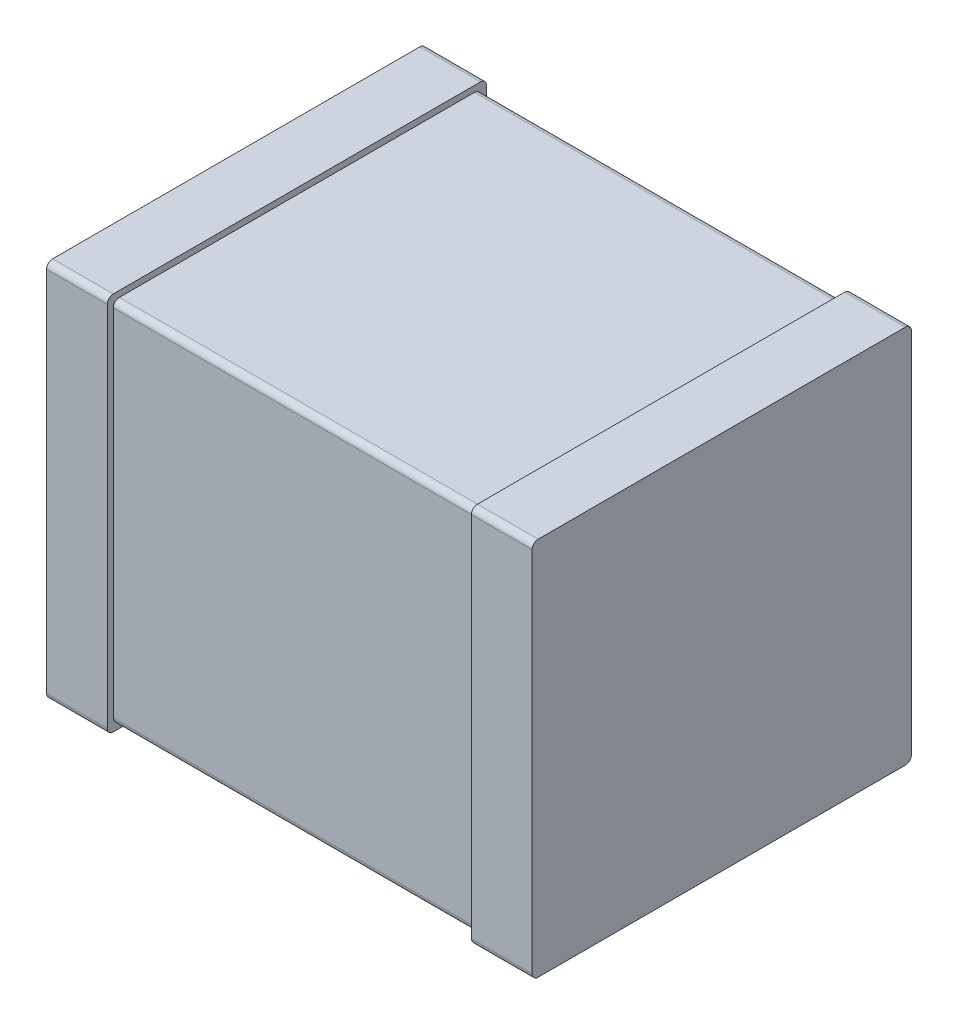
ISO-10303-21;
HEADER;
FILE_DESCRIPTION(('STEP AP214'),'2;1');
FILE_NAME('part.step','',(''),(''),'','','');
FILE_SCHEMA(('AUTOMOTIVE_DESIGN { 1 0 10303 214 1 1 1 1 }'));
ENDSEC;
DATA;
#1=APPLICATION_CONTEXT('core data for automotive mechanical design processes');
#2=APPLICATION_PROTOCOL_DEFINITION('international standard','automotive_design',2000,#1);
#3=PRODUCT_CONTEXT('',#1,'mechanical');
#4=PRODUCT('Part','Part','',(#3));
#5=PRODUCT_RELATED_PRODUCT_CATEGORY('part','',(#4));
#6=PRODUCT_DEFINITION_FORMATION('','',#4);
#7=PRODUCT_DEFINITION_CONTEXT('part definition',#1,'design');
#8=PRODUCT_DEFINITION('design','',#6,#7);
#9=PRODUCT_DEFINITION_SHAPE('','',#8);
#10=(LENGTH_UNIT() NAMED_UNIT(*) SI_UNIT(.MILLI.,.METRE.));
#11=(NAMED_UNIT(*) PLANE_ANGLE_UNIT() SI_UNIT($,.RADIAN.));
#12=(NAMED_UNIT(*) SI_UNIT($,.STERADIAN.) SOLID_ANGLE_UNIT());
#13=UNCERTAINTY_MEASURE_WITH_UNIT(LENGTH_MEASURE(1.E-05),#10,'distance_accuracy_value','');
#14=(GEOMETRIC_REPRESENTATION_CONTEXT(3) GLOBAL_UNCERTAINTY_ASSIGNED_CONTEXT((#13)) GLOBAL_UNIT_ASSIGNED_CONTEXT((#10,
#11,#12)) REPRESENTATION_CONTEXT('',''));
#15=CARTESIAN_POINT('',(0.,0.,0.));
#16=DIRECTION('',(0.,0.,1.));
#17=DIRECTION('',(1.,0.,0.));
#18=AXIS2_PLACEMENT_3D('',#15,#16,#17);
#19=CARTESIAN_POINT('',(1.6,-1.25,0.));
#20=DIRECTION('',(1.,0.,0.));
#21=DIRECTION('',(0.,1.,0.));
#22=AXIS2_PLACEMENT_3D('',#19,#20,#21);
#23=PLANE('',#22);
#24=DIRECTION('',(0.,0.,1.));
#25=VECTOR('',#24,1.);
#26=CARTESIAN_POINT('',(1.6,-1.25,0.));
#27=LINE('',#26,#25);
#28=CARTESIAN_POINT('',(1.6,-1.25,0.04));
#29=VERTEX_POINT('',#28);
#30=CARTESIAN_POINT('',(1.6,-1.25,2.46));
#31=VERTEX_POINT('',#30);
#32=EDGE_CURVE('E309',#29,#31,#27,.T.);
#33=ORIENTED_EDGE('',*,*,#32,.F.);
#34=CARTESIAN_POINT('',(1.6,-1.21,0.04));
#35=DIRECTION('',(1.,0.,0.));
#36=DIRECTION('',(0.,0.,1.));
#37=AXIS2_PLACEMENT_3D('',#34,#35,#36);
#38=CIRCLE('',#37,0.04);
#39=CARTESIAN_POINT('',(1.6,-1.21,0.));
#40=VERTEX_POINT('',#39);
#41=EDGE_CURVE('E316',#29,#40,#38,.T.);
#42=ORIENTED_EDGE('',*,*,#41,.T.);
#43=DIRECTION('',(0.,1.,0.));
#44=VECTOR('',#43,1.);
#45=CARTESIAN_POINT('',(1.6,-1.25,0.));
#46=LINE('',#45,#44);
#47=CARTESIAN_POINT('',(1.6,1.21,0.));
#48=VERTEX_POINT('',#47);
#49=EDGE_CURVE('E252',#40,#48,#46,.T.);
#50=ORIENTED_EDGE('',*,*,#49,.T.);
#51=CARTESIAN_POINT('',(1.6,1.21,0.04));
#52=DIRECTION('',(-1.,0.,0.));
#53=DIRECTION('',(0.,0.,1.));
#54=AXIS2_PLACEMENT_3D('',#51,#52,#53);
#55=CIRCLE('',#54,0.04);
#56=CARTESIAN_POINT('',(1.6,1.25,0.04));
#57=VERTEX_POINT('',#56);
#58=EDGE_CURVE('E223',#57,#48,#55,.T.);
#59=ORIENTED_EDGE('',*,*,#58,.F.);
#60=DIRECTION('',(0.,0.,1.));
#61=VECTOR('',#60,1.);
#62=CARTESIAN_POINT('',(1.6,1.25,0.));
#63=LINE('',#62,#61);
#64=CARTESIAN_POINT('',(1.6,1.25,2.46));
#65=VERTEX_POINT('',#64);
#66=EDGE_CURVE('E11',#57,#65,#63,.T.);
#67=ORIENTED_EDGE('',*,*,#66,.T.);
#68=CARTESIAN_POINT('',(1.6,1.21,2.46));
#69=DIRECTION('',(1.,0.,0.));
#70=DIRECTION('',(0.,0.,1.));
#71=AXIS2_PLACEMENT_3D('',#68,#69,#70);
#72=CIRCLE('',#71,0.04);
#73=CARTESIAN_POINT('',(1.6,1.21,2.5));
#74=VERTEX_POINT('',#73);
#75=EDGE_CURVE('E228',#65,#74,#72,.T.);
#76=ORIENTED_EDGE('',*,*,#75,.T.);
#77=DIRECTION('',(0.,1.,0.));
#78=VECTOR('',#77,1.);
#79=CARTESIAN_POINT('',(1.6,-1.25,2.5));
#80=LINE('',#79,#78);
#81=CARTESIAN_POINT('',(1.6,-1.21,2.5));
#82=VERTEX_POINT('',#81);
#83=EDGE_CURVE('E232',#82,#74,#80,.T.);
#84=ORIENTED_EDGE('',*,*,#83,.F.);
#85=CARTESIAN_POINT('',(1.6,-1.21,2.46));
#86=DIRECTION('',(-1.,0.,0.));
#87=DIRECTION('',(0.,0.,1.));
#88=AXIS2_PLACEMENT_3D('',#85,#86,#87);
#89=CIRCLE('',#88,0.04);
#90=EDGE_CURVE('E262',#31,#82,#89,.T.);
#91=ORIENTED_EDGE('',*,*,#90,.F.);
#92=EDGE_LOOP('',(#33,#42,#50,#59,#67,#76,#84,#91));
#93=FACE_BOUND('',#92,.T.);
#94=ADVANCED_FACE('F17',(#93),#23,.T.);
#95=CARTESIAN_POINT('',(1.2,1.25,0.));
#96=DIRECTION('',(0.,1.,0.));
#97=DIRECTION('',(1.,0.,0.));
#98=AXIS2_PLACEMENT_3D('',#95,#96,#97);
#99=PLANE('',#98);
#100=ORIENTED_EDGE('',*,*,#66,.F.);
#101=DIRECTION('',(1.,0.,0.));
#102=VECTOR('',#101,1.);
#103=CARTESIAN_POINT('',(1.2,1.25,0.04));
#104=LINE('',#103,#102);
#105=CARTESIAN_POINT('',(1.2,1.25,0.04));
#106=VERTEX_POINT('',#105);
#107=EDGE_CURVE('E246',#106,#57,#104,.T.);
#108=ORIENTED_EDGE('',*,*,#107,.F.);
#109=DIRECTION('',(0.,0.,1.));
#110=VECTOR('',#109,1.);
#111=CARTESIAN_POINT('',(1.2,1.25,0.));
#112=LINE('',#111,#110);
#113=CARTESIAN_POINT('',(1.2,1.25,2.46));
#114=VERTEX_POINT('',#113);
#115=EDGE_CURVE('E272',#106,#114,#112,.T.);
#116=ORIENTED_EDGE('',*,*,#115,.T.);
#117=DIRECTION('',(1.,0.,0.));
#118=VECTOR('',#117,1.);
#119=CARTESIAN_POINT('',(1.2,1.25,2.46));
#120=LINE('',#119,#118);
#121=EDGE_CURVE('E26',#114,#65,#120,.T.);
#122=ORIENTED_EDGE('',*,*,#121,.T.);
#123=EDGE_LOOP('',(#100,#108,#116,#122));
#124=FACE_BOUND('',#123,.T.);
#125=ADVANCED_FACE('F270',(#124),#99,.T.);
#126=CARTESIAN_POINT('',(1.2,1.21,2.46));
#127=DIRECTION('',(1.,0.,0.));
#128=DIRECTION('',(0.,1.,0.));
#129=AXIS2_PLACEMENT_3D('',#126,#127,#128);
#130=CYLINDRICAL_SURFACE('',#129,0.04);
#131=CARTESIAN_POINT('',(1.2,1.21,2.46));
#132=DIRECTION('',(1.,0.,0.));
#133=DIRECTION('',(0.,0.,1.));
#134=AXIS2_PLACEMENT_3D('',#131,#132,#133);
#135=CIRCLE('',#134,0.04);
#136=CARTESIAN_POINT('',(1.2,1.21,2.5));
#137=VERTEX_POINT('',#136);
#138=EDGE_CURVE('E241',#114,#137,#135,.T.);
#139=ORIENTED_EDGE('',*,*,#138,.T.);
#140=DIRECTION('',(1.,0.,0.));
#141=VECTOR('',#140,1.);
#142=CARTESIAN_POINT('',(1.2,1.21,2.5));
#143=LINE('',#142,#141);
#144=EDGE_CURVE('E238',#137,#74,#143,.T.);
#145=ORIENTED_EDGE('',*,*,#144,.T.);
#146=ORIENTED_EDGE('',*,*,#75,.F.);
#147=ORIENTED_EDGE('',*,*,#121,.F.);
#148=EDGE_LOOP('',(#139,#145,#146,#147));
#149=FACE_BOUND('',#148,.T.);
#150=ADVANCED_FACE('F239',(#149),#130,.T.);
#151=CARTESIAN_POINT('',(1.2,1.21,0.04));
#152=DIRECTION('',(1.,0.,0.));
#153=DIRECTION('',(0.,1.,0.));
#154=AXIS2_PLACEMENT_3D('',#151,#152,#153);
#155=CYLINDRICAL_SURFACE('',#154,0.04);
#156=ORIENTED_EDGE('',*,*,#107,.T.);
#157=ORIENTED_EDGE('',*,*,#58,.T.);
#158=DIRECTION('',(1.,0.,0.));
#159=VECTOR('',#158,1.);
#160=CARTESIAN_POINT('',(1.2,1.21,0.));
#161=LINE('',#160,#159);
#162=CARTESIAN_POINT('',(1.2,1.21,0.));
#163=VERTEX_POINT('',#162);
#164=EDGE_CURVE('E258',#163,#48,#161,.T.);
#165=ORIENTED_EDGE('',*,*,#164,.F.);
#166=CARTESIAN_POINT('',(1.2,1.21,0.04));
#167=DIRECTION('',(-1.,0.,0.));
#168=DIRECTION('',(0.,0.,1.));
#169=AXIS2_PLACEMENT_3D('',#166,#167,#168);
#170=CIRCLE('',#169,0.04);
#171=EDGE_CURVE('E277',#106,#163,#170,.T.);
#172=ORIENTED_EDGE('',*,*,#171,.F.);
#173=EDGE_LOOP('',(#156,#157,#165,#172));
#174=FACE_BOUND('',#173,.T.);
#175=ADVANCED_FACE('F583',(#174),#155,.T.);
#176=CARTESIAN_POINT('',(1.2,-1.25,2.5));
#177=DIRECTION('',(0.,0.,1.));
#178=DIRECTION('',(1.,0.,0.));
#179=AXIS2_PLACEMENT_3D('',#176,#177,#178);
#180=PLANE('',#179);
#181=DIRECTION('',(0.,1.,0.));
#182=VECTOR('',#181,1.);
#183=CARTESIAN_POINT('',(1.2,-1.25,2.5));
#184=LINE('',#183,#182);
#185=CARTESIAN_POINT('',(1.2,-1.21,2.5));
#186=VERTEX_POINT('',#185);
#187=EDGE_CURVE('E281',#186,#137,#184,.T.);
#188=ORIENTED_EDGE('',*,*,#187,.F.);
#189=DIRECTION('',(1.,0.,0.));
#190=VECTOR('',#189,1.);
#191=CARTESIAN_POINT('',(1.2,-1.21,2.5));
#192=LINE('',#191,#190);
#193=EDGE_CURVE('E249',#186,#82,#192,.T.);
#194=ORIENTED_EDGE('',*,*,#193,.T.);
#195=ORIENTED_EDGE('',*,*,#83,.T.);
#196=ORIENTED_EDGE('',*,*,#144,.F.);
#197=EDGE_LOOP('',(#188,#194,#195,#196));
#198=FACE_BOUND('',#197,.T.);
#199=ADVANCED_FACE('F248',(#198),#180,.T.);
#200=CARTESIAN_POINT('',(1.2,-1.25,0.));
#201=DIRECTION('',(0.,0.,1.));
#202=DIRECTION('',(1.,0.,0.));
#203=AXIS2_PLACEMENT_3D('',#200,#201,#202);
#204=PLANE('',#203);
#205=ORIENTED_EDGE('',*,*,#164,.T.);
#206=ORIENTED_EDGE('',*,*,#49,.F.);
#207=DIRECTION('',(1.,0.,0.));
#208=VECTOR('',#207,1.);
#209=CARTESIAN_POINT('',(1.2,-1.21,0.));
#210=LINE('',#209,#208);
#211=CARTESIAN_POINT('',(1.2,-1.21,0.));
#212=VERTEX_POINT('',#211);
#213=EDGE_CURVE('E313',#212,#40,#210,.T.);
#214=ORIENTED_EDGE('',*,*,#213,.F.);
#215=DIRECTION('',(0.,1.,0.));
#216=VECTOR('',#215,1.);
#217=CARTESIAN_POINT('',(1.2,-1.25,0.));
#218=LINE('',#217,#216);
#219=EDGE_CURVE('E292',#212,#163,#218,.T.);
#220=ORIENTED_EDGE('',*,*,#219,.T.);
#221=EDGE_LOOP('',(#205,#206,#214,#220));
#222=FACE_BOUND('',#221,.T.);
#223=ADVANCED_FACE('F590',(#222),#204,.F.);
#224=CARTESIAN_POINT('',(1.2,-1.21,2.46));
#225=DIRECTION('',(1.,0.,0.));
#226=DIRECTION('',(0.,-1.,0.));
#227=AXIS2_PLACEMENT_3D('',#224,#225,#226);
#228=CYLINDRICAL_SURFACE('',#227,0.04);
#229=DIRECTION('',(1.,0.,0.));
#230=VECTOR('',#229,1.);
#231=CARTESIAN_POINT('',(1.2,-1.25,2.46));
#232=LINE('',#231,#230);
#233=CARTESIAN_POINT('',(1.2,-1.25,2.46));
#234=VERTEX_POINT('',#233);
#235=EDGE_CURVE('E304',#234,#31,#232,.T.);
#236=ORIENTED_EDGE('',*,*,#235,.T.);
#237=ORIENTED_EDGE('',*,*,#90,.T.);
#238=ORIENTED_EDGE('',*,*,#193,.F.);
#239=CARTESIAN_POINT('',(1.2,-1.21,2.46));
#240=DIRECTION('',(-1.,0.,0.));
#241=DIRECTION('',(0.,0.,1.));
#242=AXIS2_PLACEMENT_3D('',#239,#240,#241);
#243=CIRCLE('',#242,0.04);
#244=EDGE_CURVE('E287',#234,#186,#243,.T.);
#245=ORIENTED_EDGE('',*,*,#244,.F.);
#246=EDGE_LOOP('',(#236,#237,#238,#245));
#247=FACE_BOUND('',#246,.T.);
#248=ADVANCED_FACE('F593',(#247),#228,.T.);
#249=CARTESIAN_POINT('',(1.2,-1.21,0.04));
#250=DIRECTION('',(1.,0.,0.));
#251=DIRECTION('',(0.,-1.,0.));
#252=AXIS2_PLACEMENT_3D('',#249,#250,#251);
#253=CYLINDRICAL_SURFACE('',#252,0.04);
#254=CARTESIAN_POINT('',(1.2,-1.21,0.04));
#255=DIRECTION('',(1.,0.,0.));
#256=DIRECTION('',(0.,0.,1.));
#257=AXIS2_PLACEMENT_3D('',#254,#255,#256);
#258=CIRCLE('',#257,0.04);
#259=CARTESIAN_POINT('',(1.2,-1.25,0.04));
#260=VERTEX_POINT('',#259);
#261=EDGE_CURVE('E296',#260,#212,#258,.T.);
#262=ORIENTED_EDGE('',*,*,#261,.T.);
#263=ORIENTED_EDGE('',*,*,#213,.T.);
#264=ORIENTED_EDGE('',*,*,#41,.F.);
#265=DIRECTION('',(1.,0.,0.));
#266=VECTOR('',#265,1.);
#267=CARTESIAN_POINT('',(1.2,-1.25,0.04));
#268=LINE('',#267,#266);
#269=EDGE_CURVE('E308',#260,#29,#268,.T.);
#270=ORIENTED_EDGE('',*,*,#269,.F.);
#271=EDGE_LOOP('',(#262,#263,#264,#270));
#272=FACE_BOUND('',#271,.T.);
#273=ADVANCED_FACE('F597',(#272),#253,.T.);
#274=CARTESIAN_POINT('',(1.2,-1.25,0.));
#275=DIRECTION('',(0.,1.,0.));
#276=DIRECTION('',(1.,0.,0.));
#277=AXIS2_PLACEMENT_3D('',#274,#275,#276);
#278=PLANE('',#277);
#279=ORIENTED_EDGE('',*,*,#235,.F.);
#280=DIRECTION('',(0.,0.,1.));
#281=VECTOR('',#280,1.);
#282=CARTESIAN_POINT('',(1.2,-1.25,0.));
#283=LINE('',#282,#281);
#284=EDGE_CURVE('E300',#260,#234,#283,.T.);
#285=ORIENTED_EDGE('',*,*,#284,.F.);
#286=ORIENTED_EDGE('',*,*,#269,.T.);
#287=ORIENTED_EDGE('',*,*,#32,.T.);
#288=EDGE_LOOP('',(#279,#285,#286,#287));
#289=FACE_BOUND('',#288,.T.);
#290=ADVANCED_FACE('F600',(#289),#278,.F.);
#291=CARTESIAN_POINT('',(1.2,-1.25,0.));
#292=DIRECTION('',(1.,0.,0.));
#293=DIRECTION('',(0.,1.,0.));
#294=AXIS2_PLACEMENT_3D('',#291,#292,#293);
#295=PLANE('',#294);
#296=DIRECTION('',(0.,1.,0.));
#297=VECTOR('',#296,1.);
#298=CARTESIAN_POINT('',(1.2,-1.21,0.04));
#299=LINE('',#298,#297);
#300=CARTESIAN_POINT('',(1.2,-1.17,0.04));
#301=VERTEX_POINT('',#300);
#302=CARTESIAN_POINT('',(1.2,1.17,0.04));
#303=VERTEX_POINT('',#302);
#304=EDGE_CURVE('E379',#301,#303,#299,.T.);
#305=ORIENTED_EDGE('',*,*,#304,.T.);
#306=CARTESIAN_POINT('',(1.2,1.17,0.08));
#307=DIRECTION('',(-1.,0.,0.));
#308=DIRECTION('',(0.,0.,1.));
#309=AXIS2_PLACEMENT_3D('',#306,#307,#308);
#310=CIRCLE('',#309,0.04);
#311=CARTESIAN_POINT('',(1.2,1.21,0.08));
#312=VERTEX_POINT('',#311);
#313=EDGE_CURVE('E390',#312,#303,#310,.T.);
#314=ORIENTED_EDGE('',*,*,#313,.F.);
#315=DIRECTION('',(0.,0.,1.));
#316=VECTOR('',#315,1.);
#317=CARTESIAN_POINT('',(1.2,1.21,0.04));
#318=LINE('',#317,#316);
#319=CARTESIAN_POINT('',(1.2,1.21,2.42));
#320=VERTEX_POINT('',#319);
#321=EDGE_CURVE('E392',#312,#320,#318,.T.);
#322=ORIENTED_EDGE('',*,*,#321,.T.);
#323=CARTESIAN_POINT('',(1.2,1.17,2.42));
#324=DIRECTION('',(1.,0.,0.));
#325=DIRECTION('',(0.,0.,1.));
#326=AXIS2_PLACEMENT_3D('',#323,#324,#325);
#327=CIRCLE('',#326,0.04);
#328=CARTESIAN_POINT('',(1.2,1.17,2.46));
#329=VERTEX_POINT('',#328);
#330=EDGE_CURVE('E402',#320,#329,#327,.T.);
#331=ORIENTED_EDGE('',*,*,#330,.T.);
#332=DIRECTION('',(0.,1.,0.));
#333=VECTOR('',#332,1.);
#334=CARTESIAN_POINT('',(1.2,-1.21,2.46));
#335=LINE('',#334,#333);
#336=CARTESIAN_POINT('',(1.2,-1.17,2.46));
#337=VERTEX_POINT('',#336);
#338=EDGE_CURVE('E410',#337,#329,#335,.T.);
#339=ORIENTED_EDGE('',*,*,#338,.F.);
#340=CARTESIAN_POINT('',(1.2,-1.17,2.42));
#341=DIRECTION('',(-1.,0.,0.));
#342=DIRECTION('',(0.,0.,1.));
#343=AXIS2_PLACEMENT_3D('',#340,#341,#342);
#344=CIRCLE('',#343,0.04);
#345=CARTESIAN_POINT('',(1.2,-1.21,2.42));
#346=VERTEX_POINT('',#345);
#347=EDGE_CURVE('E354',#346,#337,#344,.T.);
#348=ORIENTED_EDGE('',*,*,#347,.F.);
#349=DIRECTION('',(0.,0.,1.));
#350=VECTOR('',#349,1.);
#351=CARTESIAN_POINT('',(1.2,-1.21,0.04));
#352=LINE('',#351,#350);
#353=CARTESIAN_POINT('',(1.2,-1.21,0.08));
#354=VERTEX_POINT('',#353);
#355=EDGE_CURVE('E351',#354,#346,#352,.T.);
#356=ORIENTED_EDGE('',*,*,#355,.F.);
#357=CARTESIAN_POINT('',(1.2,-1.17,0.08));
#358=DIRECTION('',(1.,0.,0.));
#359=DIRECTION('',(0.,0.,1.));
#360=AXIS2_PLACEMENT_3D('',#357,#358,#359);
#361=CIRCLE('',#360,0.04);
#362=EDGE_CURVE('E370',#354,#301,#361,.T.);
#363=ORIENTED_EDGE('',*,*,#362,.T.);
#364=EDGE_LOOP('',(#305,#314,#322,#331,#339,#348,#356,#363));
#365=FACE_BOUND('',#364,.T.);
#366=ORIENTED_EDGE('',*,*,#244,.T.);
#367=ORIENTED_EDGE('',*,*,#187,.T.);
#368=ORIENTED_EDGE('',*,*,#138,.F.);
#369=ORIENTED_EDGE('',*,*,#115,.F.);
#370=ORIENTED_EDGE('',*,*,#171,.T.);
#371=ORIENTED_EDGE('',*,*,#219,.F.);
#372=ORIENTED_EDGE('',*,*,#261,.F.);
#373=ORIENTED_EDGE('',*,*,#284,.T.);
#374=EDGE_LOOP('',(#366,#367,#368,#369,#370,#371,#372,#373));
#375=FACE_BOUND('',#374,.T.);
#376=ADVANCED_FACE('F280',(#365,#375),#295,.F.);
#377=CARTESIAN_POINT('',(-1.2,-1.21,0.04));
#378=DIRECTION('',(0.,1.,0.));
#379=DIRECTION('',(1.,0.,0.));
#380=AXIS2_PLACEMENT_3D('',#377,#378,#379);
#381=PLANE('',#380);
#382=DIRECTION('',(1.,0.,0.));
#383=VECTOR('',#382,1.);
#384=CARTESIAN_POINT('',(-1.2,-1.21,2.42));
#385=LINE('',#384,#383);
#386=CARTESIAN_POINT('',(-1.2,-1.21,2.42));
#387=VERTEX_POINT('',#386);
#388=EDGE_CURVE('E290',#387,#346,#385,.T.);
#389=ORIENTED_EDGE('',*,*,#388,.F.);
#390=DIRECTION('',(0.,0.,1.));
#391=VECTOR('',#390,1.);
#392=CARTESIAN_POINT('',(-1.2,-1.21,0.04));
#393=LINE('',#392,#391);
#394=CARTESIAN_POINT('',(-1.2,-1.21,0.08));
#395=VERTEX_POINT('',#394);
#396=EDGE_CURVE('E346',#395,#387,#393,.T.);
#397=ORIENTED_EDGE('',*,*,#396,.F.);
#398=DIRECTION('',(1.,0.,0.));
#399=VECTOR('',#398,1.);
#400=CARTESIAN_POINT('',(-1.2,-1.21,0.08));
#401=LINE('',#400,#399);
#402=EDGE_CURVE('E373',#395,#354,#401,.T.);
#403=ORIENTED_EDGE('',*,*,#402,.T.);
#404=ORIENTED_EDGE('',*,*,#355,.T.);
#405=EDGE_LOOP('',(#389,#397,#403,#404));
#406=FACE_BOUND('',#405,.T.);
#407=ADVANCED_FACE('F607',(#406),#381,.F.);
#408=CARTESIAN_POINT('',(-1.2,-1.17,2.42));
#409=DIRECTION('',(1.,0.,0.));
#410=DIRECTION('',(0.,-1.,0.));
#411=AXIS2_PLACEMENT_3D('',#408,#409,#410);
#412=CYLINDRICAL_SURFACE('',#411,0.04);
#413=ORIENTED_EDGE('',*,*,#388,.T.);
#414=ORIENTED_EDGE('',*,*,#347,.T.);
#415=DIRECTION('',(1.,0.,0.));
#416=VECTOR('',#415,1.);
#417=CARTESIAN_POINT('',(-1.2,-1.17,2.46));
#418=LINE('',#417,#416);
#419=CARTESIAN_POINT('',(-1.2,-1.17,2.46));
#420=VERTEX_POINT('',#419);
#421=EDGE_CURVE('E406',#420,#337,#418,.T.);
#422=ORIENTED_EDGE('',*,*,#421,.F.);
#423=CARTESIAN_POINT('',(-1.2,-1.17,2.42));
#424=DIRECTION('',(-1.,0.,0.));
#425=DIRECTION('',(0.,0.,1.));
#426=AXIS2_PLACEMENT_3D('',#423,#424,#425);
#427=CIRCLE('',#426,0.04);
#428=EDGE_CURVE('E350',#387,#420,#427,.T.);
#429=ORIENTED_EDGE('',*,*,#428,.F.);
#430=EDGE_LOOP('',(#413,#414,#422,#429));
#431=FACE_BOUND('',#430,.T.);
#432=ADVANCED_FACE('F611',(#431),#412,.T.);
#433=CARTESIAN_POINT('',(-1.2,-1.21,2.46));
#434=DIRECTION('',(0.,0.,1.));
#435=DIRECTION('',(1.,0.,0.));
#436=AXIS2_PLACEMENT_3D('',#433,#434,#435);
#437=PLANE('',#436);
#438=DIRECTION('',(0.,1.,0.));
#439=VECTOR('',#438,1.);
#440=CARTESIAN_POINT('',(-1.2,-1.21,2.46));
#441=LINE('',#440,#439);
#442=CARTESIAN_POINT('',(-1.2,1.17,2.46));
#443=VERTEX_POINT('',#442);
#444=EDGE_CURVE('E355',#420,#443,#441,.T.);
#445=ORIENTED_EDGE('',*,*,#444,.F.);
#446=ORIENTED_EDGE('',*,*,#421,.T.);
#447=ORIENTED_EDGE('',*,*,#338,.T.);
#448=DIRECTION('',(1.,0.,0.));
#449=VECTOR('',#448,1.);
#450=CARTESIAN_POINT('',(-1.2,1.17,2.46));
#451=LINE('',#450,#449);
#452=EDGE_CURVE('E398',#443,#329,#451,.T.);
#453=ORIENTED_EDGE('',*,*,#452,.F.);
#454=EDGE_LOOP('',(#445,#446,#447,#453));
#455=FACE_BOUND('',#454,.T.);
#456=ADVANCED_FACE('F615',(#455),#437,.T.);
#457=CARTESIAN_POINT('',(-1.2,1.17,2.42));
#458=DIRECTION('',(1.,0.,0.));
#459=DIRECTION('',(0.,1.,0.));
#460=AXIS2_PLACEMENT_3D('',#457,#458,#459);
#461=CYLINDRICAL_SURFACE('',#460,0.04);
#462=CARTESIAN_POINT('',(-1.2,1.17,2.42));
#463=DIRECTION('',(1.,0.,0.));
#464=DIRECTION('',(0.,0.,1.));
#465=AXIS2_PLACEMENT_3D('',#462,#463,#464);
#466=CIRCLE('',#465,0.04);
#467=CARTESIAN_POINT('',(-1.2,1.21,2.42));
#468=VERTEX_POINT('',#467);
#469=EDGE_CURVE('E359',#468,#443,#466,.T.);
#470=ORIENTED_EDGE('',*,*,#469,.T.);
#471=ORIENTED_EDGE('',*,*,#452,.T.);
#472=ORIENTED_EDGE('',*,*,#330,.F.);
#473=DIRECTION('',(1.,0.,0.));
#474=VECTOR('',#473,1.);
#475=CARTESIAN_POINT('',(-1.2,1.21,2.42));
#476=LINE('',#475,#474);
#477=EDGE_CURVE('E397',#468,#320,#476,.T.);
#478=ORIENTED_EDGE('',*,*,#477,.F.);
#479=EDGE_LOOP('',(#470,#471,#472,#478));
#480=FACE_BOUND('',#479,.T.);
#481=ADVANCED_FACE('F626',(#480),#461,.T.);
#482=CARTESIAN_POINT('',(-1.2,1.21,0.04));
#483=DIRECTION('',(0.,1.,0.));
#484=DIRECTION('',(1.,0.,0.));
#485=AXIS2_PLACEMENT_3D('',#482,#483,#484);
#486=PLANE('',#485);
#487=ORIENTED_EDGE('',*,*,#321,.F.);
#488=DIRECTION('',(1.,0.,0.));
#489=VECTOR('',#488,1.);
#490=CARTESIAN_POINT('',(-1.2,1.21,0.08));
#491=LINE('',#490,#489);
#492=CARTESIAN_POINT('',(-1.2,1.21,0.08));
#493=VERTEX_POINT('',#492);
#494=EDGE_CURVE('E386',#493,#312,#491,.T.);
#495=ORIENTED_EDGE('',*,*,#494,.F.);
#496=DIRECTION('',(0.,0.,1.));
#497=VECTOR('',#496,1.);
#498=CARTESIAN_POINT('',(-1.2,1.21,0.04));
#499=LINE('',#498,#497);
#500=EDGE_CURVE('E363',#493,#468,#499,.T.);
#501=ORIENTED_EDGE('',*,*,#500,.T.);
#502=ORIENTED_EDGE('',*,*,#477,.T.);
#503=EDGE_LOOP('',(#487,#495,#501,#502));
#504=FACE_BOUND('',#503,.T.);
#505=ADVANCED_FACE('F620',(#504),#486,.T.);
#506=CARTESIAN_POINT('',(-1.2,1.17,0.08));
#507=DIRECTION('',(1.,0.,0.));
#508=DIRECTION('',(0.,1.,0.));
#509=AXIS2_PLACEMENT_3D('',#506,#507,#508);
#510=CYLINDRICAL_SURFACE('',#509,0.04);
#511=ORIENTED_EDGE('',*,*,#494,.T.);
#512=ORIENTED_EDGE('',*,*,#313,.T.);
#513=DIRECTION('',(1.,0.,0.));
#514=VECTOR('',#513,1.);
#515=CARTESIAN_POINT('',(-1.2,1.17,0.04));
#516=LINE('',#515,#514);
#517=CARTESIAN_POINT('',(-1.2,1.17,0.04));
#518=VERTEX_POINT('',#517);
#519=EDGE_CURVE('E375',#518,#303,#516,.T.);
#520=ORIENTED_EDGE('',*,*,#519,.F.);
#521=CARTESIAN_POINT('',(-1.2,1.17,0.08));
#522=DIRECTION('',(-1.,0.,0.));
#523=DIRECTION('',(0.,0.,1.));
#524=AXIS2_PLACEMENT_3D('',#521,#522,#523);
#525=CIRCLE('',#524,0.04);
#526=EDGE_CURVE('E342',#493,#518,#525,.T.);
#527=ORIENTED_EDGE('',*,*,#526,.F.);
#528=EDGE_LOOP('',(#511,#512,#520,#527));
#529=FACE_BOUND('',#528,.T.);
#530=ADVANCED_FACE('F616',(#529),#510,.T.);
#531=CARTESIAN_POINT('',(-1.2,-1.21,0.04));
#532=DIRECTION('',(0.,0.,1.));
#533=DIRECTION('',(1.,0.,0.));
#534=AXIS2_PLACEMENT_3D('',#531,#532,#533);
#535=PLANE('',#534);
#536=ORIENTED_EDGE('',*,*,#519,.T.);
#537=ORIENTED_EDGE('',*,*,#304,.F.);
#538=DIRECTION('',(1.,0.,0.));
#539=VECTOR('',#538,1.);
#540=CARTESIAN_POINT('',(-1.2,-1.17,0.04));
#541=LINE('',#540,#539);
#542=CARTESIAN_POINT('',(-1.2,-1.17,0.04));
#543=VERTEX_POINT('',#542);
#544=EDGE_CURVE('E341',#543,#301,#541,.T.);
#545=ORIENTED_EDGE('',*,*,#544,.F.);
#546=DIRECTION('',(0.,1.,0.));
#547=VECTOR('',#546,1.);
#548=CARTESIAN_POINT('',(-1.2,-1.21,0.04));
#549=LINE('',#548,#547);
#550=EDGE_CURVE('E337',#543,#518,#549,.T.);
#551=ORIENTED_EDGE('',*,*,#550,.T.);
#552=EDGE_LOOP('',(#536,#537,#545,#551));
#553=FACE_BOUND('',#552,.T.);
#554=ADVANCED_FACE('F619',(#553),#535,.F.);
#555=CARTESIAN_POINT('',(-1.2,-1.17,0.08));
#556=DIRECTION('',(1.,0.,0.));
#557=DIRECTION('',(0.,-1.,0.));
#558=AXIS2_PLACEMENT_3D('',#555,#556,#557);
#559=CYLINDRICAL_SURFACE('',#558,0.04);
#560=CARTESIAN_POINT('',(-1.2,-1.17,0.08));
#561=DIRECTION('',(1.,0.,0.));
#562=DIRECTION('',(0.,0.,1.));
#563=AXIS2_PLACEMENT_3D('',#560,#561,#562);
#564=CIRCLE('',#563,0.04);
#565=EDGE_CURVE('E336',#395,#543,#564,.T.);
#566=ORIENTED_EDGE('',*,*,#565,.T.);
#567=ORIENTED_EDGE('',*,*,#544,.T.);
#568=ORIENTED_EDGE('',*,*,#362,.F.);
#569=ORIENTED_EDGE('',*,*,#402,.F.);
#570=EDGE_LOOP('',(#566,#567,#568,#569));
#571=FACE_BOUND('',#570,.T.);
#572=ADVANCED_FACE('F624',(#571),#559,.T.);
#573=CARTESIAN_POINT('',(-1.2,-1.25,0.));
#574=DIRECTION('',(1.,0.,0.));
#575=DIRECTION('',(0.,1.,0.));
#576=AXIS2_PLACEMENT_3D('',#573,#574,#575);
#577=PLANE('',#576);
#578=ORIENTED_EDGE('',*,*,#565,.F.);
#579=ORIENTED_EDGE('',*,*,#396,.T.);
#580=ORIENTED_EDGE('',*,*,#428,.T.);
#581=ORIENTED_EDGE('',*,*,#444,.T.);
#582=ORIENTED_EDGE('',*,*,#469,.F.);
#583=ORIENTED_EDGE('',*,*,#500,.F.);
#584=ORIENTED_EDGE('',*,*,#526,.T.);
#585=ORIENTED_EDGE('',*,*,#550,.F.);
#586=EDGE_LOOP('',(#578,#579,#580,#581,#582,#583,#584,#585));
#587=FACE_BOUND('',#586,.T.);
#588=DIRECTION('',(0.,0.,1.));
#589=VECTOR('',#588,1.);
#590=CARTESIAN_POINT('',(-1.2,-1.25,0.));
#591=LINE('',#590,#589);
#592=CARTESIAN_POINT('',(-1.2,-1.25,0.04));
#593=VERTEX_POINT('',#592);
#594=CARTESIAN_POINT('',(-1.2,-1.25,2.46));
#595=VERTEX_POINT('',#594);
#596=EDGE_CURVE('E438',#593,#595,#591,.T.);
#597=ORIENTED_EDGE('',*,*,#596,.F.);
#598=CARTESIAN_POINT('',(-1.2,-1.21,0.04));
#599=DIRECTION('',(1.,0.,0.));
#600=DIRECTION('',(0.,0.,1.));
#601=AXIS2_PLACEMENT_3D('',#598,#599,#600);
#602=CIRCLE('',#601,0.04);
#603=CARTESIAN_POINT('',(-1.2,-1.21,0.));
#604=VERTEX_POINT('',#603);
#605=EDGE_CURVE('E437',#593,#604,#602,.T.);
#606=ORIENTED_EDGE('',*,*,#605,.T.);
#607=DIRECTION('',(0.,1.,0.));
#608=VECTOR('',#607,1.);
#609=CARTESIAN_POINT('',(-1.2,-1.25,0.));
#610=LINE('',#609,#608);
#611=CARTESIAN_POINT('',(-1.2,1.21,0.));
#612=VERTEX_POINT('',#611);
#613=EDGE_CURVE('E482',#604,#612,#610,.T.);
#614=ORIENTED_EDGE('',*,*,#613,.T.);
#615=CARTESIAN_POINT('',(-1.2,1.21,0.04));
#616=DIRECTION('',(-1.,0.,0.));
#617=DIRECTION('',(0.,0.,1.));
#618=AXIS2_PLACEMENT_3D('',#615,#616,#617);
#619=CIRCLE('',#618,0.04);
#620=CARTESIAN_POINT('',(-1.2,1.25,0.04));
#621=VERTEX_POINT('',#620);
#622=EDGE_CURVE('E464',#621,#612,#619,.T.);
#623=ORIENTED_EDGE('',*,*,#622,.F.);
#624=DIRECTION('',(0.,0.,1.));
#625=VECTOR('',#624,1.);
#626=CARTESIAN_POINT('',(-1.2,1.25,0.));
#627=LINE('',#626,#625);
#628=CARTESIAN_POINT('',(-1.2,1.25,2.46));
#629=VERTEX_POINT('',#628);
#630=EDGE_CURVE('E334',#621,#629,#627,.T.);
#631=ORIENTED_EDGE('',*,*,#630,.T.);
#632=CARTESIAN_POINT('',(-1.2,1.21,2.46));
#633=DIRECTION('',(1.,0.,0.));
#634=DIRECTION('',(0.,0.,1.));
#635=AXIS2_PLACEMENT_3D('',#632,#633,#634);
#636=CIRCLE('',#635,0.04);
#637=CARTESIAN_POINT('',(-1.2,1.21,2.5));
#638=VERTEX_POINT('',#637);
#639=EDGE_CURVE('E496',#629,#638,#636,.T.);
#640=ORIENTED_EDGE('',*,*,#639,.T.);
#641=DIRECTION('',(0.,1.,0.));
#642=VECTOR('',#641,1.);
#643=CARTESIAN_POINT('',(-1.2,-1.25,2.5));
#644=LINE('',#643,#642);
#645=CARTESIAN_POINT('',(-1.2,-1.21,2.5));
#646=VERTEX_POINT('',#645);
#647=EDGE_CURVE('E486',#646,#638,#644,.T.);
#648=ORIENTED_EDGE('',*,*,#647,.F.);
#649=CARTESIAN_POINT('',(-1.2,-1.21,2.46));
#650=DIRECTION('',(-1.,0.,0.));
#651=DIRECTION('',(0.,0.,1.));
#652=AXIS2_PLACEMENT_3D('',#649,#650,#651);
#653=CIRCLE('',#652,0.04);
#654=EDGE_CURVE('E439',#595,#646,#653,.T.);
#655=ORIENTED_EDGE('',*,*,#654,.F.);
#656=EDGE_LOOP('',(#597,#606,#614,#623,#631,#640,#648,#655));
#657=FACE_BOUND('',#656,.T.);
#658=ADVANCED_FACE('F537',(#587,#657),#577,.T.);
#659=CARTESIAN_POINT('',(-1.6,1.25,0.));
#660=DIRECTION('',(0.,1.,0.));
#661=DIRECTION('',(1.,0.,0.));
#662=AXIS2_PLACEMENT_3D('',#659,#660,#661);
#663=PLANE('',#662);
#664=ORIENTED_EDGE('',*,*,#630,.F.);
#665=DIRECTION('',(1.,0.,0.));
#666=VECTOR('',#665,1.);
#667=CARTESIAN_POINT('',(-1.6,1.25,0.04));
#668=LINE('',#667,#666);
#669=CARTESIAN_POINT('',(-1.6,1.25,0.04));
#670=VERTEX_POINT('',#669);
#671=EDGE_CURVE('E460',#670,#621,#668,.T.);
#672=ORIENTED_EDGE('',*,*,#671,.F.);
#673=DIRECTION('',(0.,0.,1.));
#674=VECTOR('',#673,1.);
#675=CARTESIAN_POINT('',(-1.6,1.25,0.));
#676=LINE('',#675,#674);
#677=CARTESIAN_POINT('',(-1.6,1.25,2.46));
#678=VERTEX_POINT('',#677);
#679=EDGE_CURVE('E427',#670,#678,#676,.T.);
#680=ORIENTED_EDGE('',*,*,#679,.T.);
#681=DIRECTION('',(1.,0.,0.));
#682=VECTOR('',#681,1.);
#683=CARTESIAN_POINT('',(-1.6,1.25,2.46));
#684=LINE('',#683,#682);
#685=EDGE_CURVE('E332',#678,#629,#684,.T.);
#686=ORIENTED_EDGE('',*,*,#685,.T.);
#687=EDGE_LOOP('',(#664,#672,#680,#686));
#688=FACE_BOUND('',#687,.T.);
#689=ADVANCED_FACE('F562',(#688),#663,.T.);
#690=CARTESIAN_POINT('',(-1.6,1.21,2.46));
#691=DIRECTION('',(1.,0.,0.));
#692=DIRECTION('',(0.,1.,0.));
#693=AXIS2_PLACEMENT_3D('',#690,#691,#692);
#694=CYLINDRICAL_SURFACE('',#693,0.04);
#695=CARTESIAN_POINT('',(-1.6,1.21,2.46));
#696=DIRECTION('',(1.,0.,0.));
#697=DIRECTION('',(0.,0.,1.));
#698=AXIS2_PLACEMENT_3D('',#695,#696,#697);
#699=CIRCLE('',#698,0.04);
#700=CARTESIAN_POINT('',(-1.6,1.21,2.5));
#701=VERTEX_POINT('',#700);
#702=EDGE_CURVE('E511',#678,#701,#699,.T.);
#703=ORIENTED_EDGE('',*,*,#702,.T.);
#704=DIRECTION('',(1.,0.,0.));
#705=VECTOR('',#704,1.);
#706=CARTESIAN_POINT('',(-1.6,1.21,2.5));
#707=LINE('',#706,#705);
#708=EDGE_CURVE('E465',#701,#638,#707,.T.);
#709=ORIENTED_EDGE('',*,*,#708,.T.);
#710=ORIENTED_EDGE('',*,*,#639,.F.);
#711=ORIENTED_EDGE('',*,*,#685,.F.);
#712=EDGE_LOOP('',(#703,#709,#710,#711));
#713=FACE_BOUND('',#712,.T.);
#714=ADVANCED_FACE('F559',(#713),#694,.T.);
#715=CARTESIAN_POINT('',(-1.6,1.21,0.04));
#716=DIRECTION('',(1.,0.,0.));
#717=DIRECTION('',(0.,1.,0.));
#718=AXIS2_PLACEMENT_3D('',#715,#716,#717);
#719=CYLINDRICAL_SURFACE('',#718,0.04);
#720=ORIENTED_EDGE('',*,*,#671,.T.);
#721=ORIENTED_EDGE('',*,*,#622,.T.);
#722=DIRECTION('',(1.,0.,0.));
#723=VECTOR('',#722,1.);
#724=CARTESIAN_POINT('',(-1.6,1.21,0.));
#725=LINE('',#724,#723);
#726=CARTESIAN_POINT('',(-1.6,1.21,0.));
#727=VERTEX_POINT('',#726);
#728=EDGE_CURVE('E481',#727,#612,#725,.T.);
#729=ORIENTED_EDGE('',*,*,#728,.F.);
#730=CARTESIAN_POINT('',(-1.6,1.21,0.04));
#731=DIRECTION('',(-1.,0.,0.));
#732=DIRECTION('',(0.,0.,1.));
#733=AXIS2_PLACEMENT_3D('',#730,#731,#732);
#734=CIRCLE('',#733,0.04);
#735=EDGE_CURVE('E429',#670,#727,#734,.T.);
#736=ORIENTED_EDGE('',*,*,#735,.F.);
#737=EDGE_LOOP('',(#720,#721,#729,#736));
#738=FACE_BOUND('',#737,.T.);
#739=ADVANCED_FACE('F564',(#738),#719,.T.);
#740=CARTESIAN_POINT('',(-1.6,-1.25,2.5));
#741=DIRECTION('',(0.,0.,1.));
#742=DIRECTION('',(1.,0.,0.));
#743=AXIS2_PLACEMENT_3D('',#740,#741,#742);
#744=PLANE('',#743);
#745=DIRECTION('',(0.,1.,0.));
#746=VECTOR('',#745,1.);
#747=CARTESIAN_POINT('',(-1.6,-1.25,2.5));
#748=LINE('',#747,#746);
#749=CARTESIAN_POINT('',(-1.6,-1.21,2.5));
#750=VERTEX_POINT('',#749);
#751=EDGE_CURVE('E510',#750,#701,#748,.T.);
#752=ORIENTED_EDGE('',*,*,#751,.F.);
#753=DIRECTION('',(1.,0.,0.));
#754=VECTOR('',#753,1.);
#755=CARTESIAN_POINT('',(-1.6,-1.21,2.5));
#756=LINE('',#755,#754);
#757=EDGE_CURVE('E443',#750,#646,#756,.T.);
#758=ORIENTED_EDGE('',*,*,#757,.T.);
#759=ORIENTED_EDGE('',*,*,#647,.T.);
#760=ORIENTED_EDGE('',*,*,#708,.F.);
#761=EDGE_LOOP('',(#752,#758,#759,#760));
#762=FACE_BOUND('',#761,.T.);
#763=ADVANCED_FACE('F557',(#762),#744,.T.);
#764=CARTESIAN_POINT('',(-1.6,-1.25,0.));
#765=DIRECTION('',(0.,0.,1.));
#766=DIRECTION('',(1.,0.,0.));
#767=AXIS2_PLACEMENT_3D('',#764,#765,#766);
#768=PLANE('',#767);
#769=ORIENTED_EDGE('',*,*,#728,.T.);
#770=ORIENTED_EDGE('',*,*,#613,.F.);
#771=DIRECTION('',(1.,0.,0.));
#772=VECTOR('',#771,1.);
#773=CARTESIAN_POINT('',(-1.6,-1.21,0.));
#774=LINE('',#773,#772);
#775=CARTESIAN_POINT('',(-1.6,-1.21,0.));
#776=VERTEX_POINT('',#775);
#777=EDGE_CURVE('E433',#776,#604,#774,.T.);
#778=ORIENTED_EDGE('',*,*,#777,.F.);
#779=DIRECTION('',(0.,1.,0.));
#780=VECTOR('',#779,1.);
#781=CARTESIAN_POINT('',(-1.6,-1.25,0.));
#782=LINE('',#781,#780);
#783=EDGE_CURVE('E432',#776,#727,#782,.T.);
#784=ORIENTED_EDGE('',*,*,#783,.T.);
#785=EDGE_LOOP('',(#769,#770,#778,#784));
#786=FACE_BOUND('',#785,.T.);
#787=ADVANCED_FACE('F535',(#786),#768,.F.);
#788=CARTESIAN_POINT('',(-1.6,-1.21,2.46));
#789=DIRECTION('',(1.,0.,0.));
#790=DIRECTION('',(0.,-1.,0.));
#791=AXIS2_PLACEMENT_3D('',#788,#789,#790);
#792=CYLINDRICAL_SURFACE('',#791,0.04);
#793=DIRECTION('',(1.,0.,0.));
#794=VECTOR('',#793,1.);
#795=CARTESIAN_POINT('',(-1.6,-1.25,2.46));
#796=LINE('',#795,#794);
#797=CARTESIAN_POINT('',(-1.6,-1.25,2.46));
#798=VERTEX_POINT('',#797);
#799=EDGE_CURVE('E452',#798,#595,#796,.T.);
#800=ORIENTED_EDGE('',*,*,#799,.T.);
#801=ORIENTED_EDGE('',*,*,#654,.T.);
#802=ORIENTED_EDGE('',*,*,#757,.F.);
#803=CARTESIAN_POINT('',(-1.6,-1.21,2.46));
#804=DIRECTION('',(-1.,0.,0.));
#805=DIRECTION('',(0.,0.,1.));
#806=AXIS2_PLACEMENT_3D('',#803,#804,#805);
#807=CIRCLE('',#806,0.04);
#808=EDGE_CURVE('E542',#798,#750,#807,.T.);
#809=ORIENTED_EDGE('',*,*,#808,.F.);
#810=EDGE_LOOP('',(#800,#801,#802,#809));
#811=FACE_BOUND('',#810,.T.);
#812=ADVANCED_FACE('F544',(#811),#792,.T.);
#813=CARTESIAN_POINT('',(-1.6,-1.21,0.04));
#814=DIRECTION('',(1.,0.,0.));
#815=DIRECTION('',(0.,-1.,0.));
#816=AXIS2_PLACEMENT_3D('',#813,#814,#815);
#817=CYLINDRICAL_SURFACE('',#816,0.04);
#818=CARTESIAN_POINT('',(-1.6,-1.21,0.04));
#819=DIRECTION('',(1.,0.,0.));
#820=DIRECTION('',(0.,0.,1.));
#821=AXIS2_PLACEMENT_3D('',#818,#819,#820);
#822=CIRCLE('',#821,0.04);
#823=CARTESIAN_POINT('',(-1.6,-1.25,0.04));
#824=VERTEX_POINT('',#823);
#825=EDGE_CURVE('E447',#824,#776,#822,.T.);
#826=ORIENTED_EDGE('',*,*,#825,.T.);
#827=ORIENTED_EDGE('',*,*,#777,.T.);
#828=ORIENTED_EDGE('',*,*,#605,.F.);
#829=DIRECTION('',(1.,0.,0.));
#830=VECTOR('',#829,1.);
#831=CARTESIAN_POINT('',(-1.6,-1.25,0.04));
#832=LINE('',#831,#830);
#833=EDGE_CURVE('E453',#824,#593,#832,.T.);
#834=ORIENTED_EDGE('',*,*,#833,.F.);
#835=EDGE_LOOP('',(#826,#827,#828,#834));
#836=FACE_BOUND('',#835,.T.);
#837=ADVANCED_FACE('F526',(#836),#817,.T.);
#838=CARTESIAN_POINT('',(-1.6,-1.25,0.));
#839=DIRECTION('',(0.,1.,0.));
#840=DIRECTION('',(1.,0.,0.));
#841=AXIS2_PLACEMENT_3D('',#838,#839,#840);
#842=PLANE('',#841);
#843=ORIENTED_EDGE('',*,*,#799,.F.);
#844=DIRECTION('',(0.,0.,1.));
#845=VECTOR('',#844,1.);
#846=CARTESIAN_POINT('',(-1.6,-1.25,0.));
#847=LINE('',#846,#845);
#848=EDGE_CURVE('E448',#824,#798,#847,.T.);
#849=ORIENTED_EDGE('',*,*,#848,.F.);
#850=ORIENTED_EDGE('',*,*,#833,.T.);
#851=ORIENTED_EDGE('',*,*,#596,.T.);
#852=EDGE_LOOP('',(#843,#849,#850,#851));
#853=FACE_BOUND('',#852,.T.);
#854=ADVANCED_FACE('F539',(#853),#842,.F.);
#855=CARTESIAN_POINT('',(-1.6,-1.25,0.));
#856=DIRECTION('',(1.,0.,0.));
#857=DIRECTION('',(0.,1.,0.));
#858=AXIS2_PLACEMENT_3D('',#855,#856,#857);
#859=PLANE('',#858);
#860=ORIENTED_EDGE('',*,*,#808,.T.);
#861=ORIENTED_EDGE('',*,*,#751,.T.);
#862=ORIENTED_EDGE('',*,*,#702,.F.);
#863=ORIENTED_EDGE('',*,*,#679,.F.);
#864=ORIENTED_EDGE('',*,*,#735,.T.);
#865=ORIENTED_EDGE('',*,*,#783,.F.);
#866=ORIENTED_EDGE('',*,*,#825,.F.);
#867=ORIENTED_EDGE('',*,*,#848,.T.);
#868=EDGE_LOOP('',(#860,#861,#862,#863,#864,#865,#866,#867));
#869=FACE_BOUND('',#868,.T.);
#870=ADVANCED_FACE('F530',(#869),#859,.F.);
#871=CLOSED_SHELL('',(#94,#125,#150,#175,#199,#223,#248,#273,#290,#376,#407,#432,#456,#481,#505,
#530,#554,#572,#658,#689,#714,#739,#763,#787,#812,#837,#854,#870));
#872=MANIFOLD_SOLID_BREP('B1',#871);
#873=ADVANCED_BREP_SHAPE_REPRESENTATION('',(#18,#872),#14);
#874=SHAPE_DEFINITION_REPRESENTATION(#9,#873);
ENDSEC;
END-ISO-10303-21;
